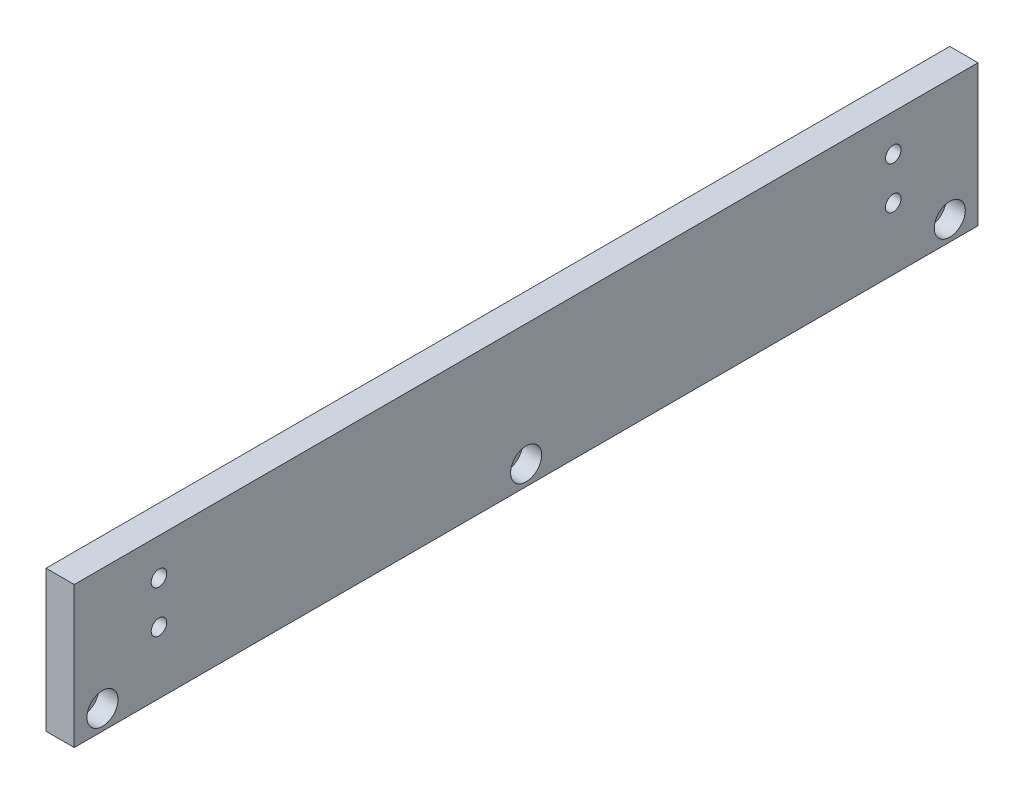
ISO-10303-21;
HEADER;
FILE_DESCRIPTION(('STEP AP214'),'2;1');
FILE_NAME('part.step','',(''),(''),'','','');
FILE_SCHEMA(('AUTOMOTIVE_DESIGN { 1 0 10303 214 1 1 1 1 }'));
ENDSEC;
DATA;
#1=APPLICATION_CONTEXT('core data for automotive mechanical design processes');
#2=APPLICATION_PROTOCOL_DEFINITION('international standard','automotive_design',2000,#1);
#3=PRODUCT_CONTEXT('',#1,'mechanical');
#4=PRODUCT('Part','Part','',(#3));
#5=PRODUCT_RELATED_PRODUCT_CATEGORY('part','',(#4));
#6=PRODUCT_DEFINITION_FORMATION('','',#4);
#7=PRODUCT_DEFINITION_CONTEXT('part definition',#1,'design');
#8=PRODUCT_DEFINITION('design','',#6,#7);
#9=PRODUCT_DEFINITION_SHAPE('','',#8);
#10=(LENGTH_UNIT() NAMED_UNIT(*) SI_UNIT(.MILLI.,.METRE.));
#11=(NAMED_UNIT(*) PLANE_ANGLE_UNIT() SI_UNIT($,.RADIAN.));
#12=(NAMED_UNIT(*) SI_UNIT($,.STERADIAN.) SOLID_ANGLE_UNIT());
#13=UNCERTAINTY_MEASURE_WITH_UNIT(LENGTH_MEASURE(1.E-05),#10,'distance_accuracy_value','');
#14=(GEOMETRIC_REPRESENTATION_CONTEXT(3) GLOBAL_UNCERTAINTY_ASSIGNED_CONTEXT((#13)) GLOBAL_UNIT_ASSIGNED_CONTEXT((#10,
#11,#12)) REPRESENTATION_CONTEXT('',''));
#15=CARTESIAN_POINT('',(0.,0.,0.));
#16=DIRECTION('',(0.,0.,1.));
#17=DIRECTION('',(1.,0.,0.));
#18=AXIS2_PLACEMENT_3D('',#15,#16,#17);
#19=CARTESIAN_POINT('',(0.,50.,320.));
#20=DIRECTION('',(1.,0.,0.));
#21=DIRECTION('',(0.,0.,-1.));
#22=AXIS2_PLACEMENT_3D('',#19,#20,#21);
#23=PLANE('',#22);
#24=CARTESIAN_POINT('',(0.,37.,290.));
#25=DIRECTION('',(-1.,0.,0.));
#26=DIRECTION('',(0.,0.,1.));
#27=AXIS2_PLACEMENT_3D('',#24,#25,#26);
#28=CIRCLE('',#27,5.);
#29=CARTESIAN_POINT('',(0.,37.,295.));
#30=VERTEX_POINT('',#29);
#31=EDGE_CURVE('E192',#30,#30,#28,.T.);
#32=ORIENTED_EDGE('',*,*,#31,.F.);
#33=EDGE_LOOP('',(#32));
#34=FACE_BOUND('',#33,.T.);
#35=CARTESIAN_POINT('',(0.,22.,290.));
#36=DIRECTION('',(-1.,0.,0.));
#37=DIRECTION('',(0.,0.,1.));
#38=AXIS2_PLACEMENT_3D('',#35,#36,#37);
#39=CIRCLE('',#38,5.);
#40=CARTESIAN_POINT('',(0.,22.,295.));
#41=VERTEX_POINT('',#40);
#42=EDGE_CURVE('E180',#41,#41,#39,.T.);
#43=ORIENTED_EDGE('',*,*,#42,.F.);
#44=EDGE_LOOP('',(#43));
#45=FACE_BOUND('',#44,.T.);
#46=CARTESIAN_POINT('',(0.,37.,30.));
#47=DIRECTION('',(-1.,0.,0.));
#48=DIRECTION('',(0.,0.,1.));
#49=AXIS2_PLACEMENT_3D('',#46,#47,#48);
#50=CIRCLE('',#49,5.);
#51=CARTESIAN_POINT('',(0.,37.,35.));
#52=VERTEX_POINT('',#51);
#53=EDGE_CURVE('E168',#52,#52,#50,.T.);
#54=ORIENTED_EDGE('',*,*,#53,.F.);
#55=EDGE_LOOP('',(#54));
#56=FACE_BOUND('',#55,.T.);
#57=CARTESIAN_POINT('',(0.,22.,30.));
#58=DIRECTION('',(-1.,0.,0.));
#59=DIRECTION('',(0.,0.,1.));
#60=AXIS2_PLACEMENT_3D('',#57,#58,#59);
#61=CIRCLE('',#60,5.);
#62=CARTESIAN_POINT('',(0.,22.,35.));
#63=VERTEX_POINT('',#62);
#64=EDGE_CURVE('E156',#63,#63,#61,.T.);
#65=ORIENTED_EDGE('',*,*,#64,.F.);
#66=EDGE_LOOP('',(#65));
#67=FACE_BOUND('',#66,.T.);
#68=CARTESIAN_POINT('',(0.,7.,310.));
#69=DIRECTION('',(1.,0.,0.));
#70=DIRECTION('',(0.,0.,-1.));
#71=AXIS2_PLACEMENT_3D('',#68,#69,#70);
#72=CIRCLE('',#71,3.3);
#73=CARTESIAN_POINT('',(0.,7.,306.7));
#74=VERTEX_POINT('',#73);
#75=EDGE_CURVE('E135',#74,#74,#72,.T.);
#76=ORIENTED_EDGE('',*,*,#75,.T.);
#77=EDGE_LOOP('',(#76));
#78=FACE_BOUND('',#77,.T.);
#79=CARTESIAN_POINT('',(0.,7.,160.));
#80=DIRECTION('',(1.,0.,0.));
#81=DIRECTION('',(0.,0.,-1.));
#82=AXIS2_PLACEMENT_3D('',#79,#80,#81);
#83=CIRCLE('',#82,3.3);
#84=CARTESIAN_POINT('',(0.,7.,156.7));
#85=VERTEX_POINT('',#84);
#86=EDGE_CURVE('E123',#85,#85,#83,.T.);
#87=ORIENTED_EDGE('',*,*,#86,.T.);
#88=EDGE_LOOP('',(#87));
#89=FACE_BOUND('',#88,.T.);
#90=CARTESIAN_POINT('',(0.,7.,10.));
#91=DIRECTION('',(1.,0.,0.));
#92=DIRECTION('',(0.,0.,-1.));
#93=AXIS2_PLACEMENT_3D('',#90,#91,#92);
#94=CIRCLE('',#93,3.3);
#95=CARTESIAN_POINT('',(0.,7.,6.70000000000001));
#96=VERTEX_POINT('',#95);
#97=EDGE_CURVE('E101',#96,#96,#94,.T.);
#98=ORIENTED_EDGE('',*,*,#97,.T.);
#99=EDGE_LOOP('',(#98));
#100=FACE_BOUND('',#99,.T.);
#101=DIRECTION('',(0.,-1.,0.));
#102=VECTOR('',#101,1.);
#103=CARTESIAN_POINT('',(0.,50.,0.));
#104=LINE('',#103,#102);
#105=CARTESIAN_POINT('',(0.,50.,0.));
#106=VERTEX_POINT('',#105);
#107=CARTESIAN_POINT('',(0.,0.,0.));
#108=VERTEX_POINT('',#107);
#109=EDGE_CURVE('E98',#106,#108,#104,.T.);
#110=ORIENTED_EDGE('',*,*,#109,.T.);
#111=DIRECTION('',(0.,0.,-1.));
#112=VECTOR('',#111,1.);
#113=CARTESIAN_POINT('',(0.,0.,320.));
#114=LINE('',#113,#112);
#115=CARTESIAN_POINT('',(0.,0.,320.));
#116=VERTEX_POINT('',#115);
#117=EDGE_CURVE('E11',#116,#108,#114,.T.);
#118=ORIENTED_EDGE('',*,*,#117,.F.);
#119=DIRECTION('',(0.,-1.,0.));
#120=VECTOR('',#119,1.);
#121=CARTESIAN_POINT('',(0.,50.,320.));
#122=LINE('',#121,#120);
#123=CARTESIAN_POINT('',(0.,50.,320.));
#124=VERTEX_POINT('',#123);
#125=EDGE_CURVE('E86',#124,#116,#122,.T.);
#126=ORIENTED_EDGE('',*,*,#125,.F.);
#127=DIRECTION('',(0.,0.,-1.));
#128=VECTOR('',#127,1.);
#129=CARTESIAN_POINT('',(0.,50.,320.));
#130=LINE('',#129,#128);
#131=EDGE_CURVE('E94',#124,#106,#130,.T.);
#132=ORIENTED_EDGE('',*,*,#131,.T.);
#133=EDGE_LOOP('',(#110,#118,#126,#132));
#134=FACE_BOUND('',#133,.T.);
#135=ADVANCED_FACE('F35',(#34,#45,#56,#67,#78,#89,#100,#134),#23,.F.);
#136=CARTESIAN_POINT('',(0.,0.,320.));
#137=DIRECTION('',(0.,1.,0.));
#138=DIRECTION('',(0.,0.,1.));
#139=AXIS2_PLACEMENT_3D('',#136,#137,#138);
#140=PLANE('',#139);
#141=DIRECTION('',(1.,0.,0.));
#142=VECTOR('',#141,1.);
#143=CARTESIAN_POINT('',(0.,0.,0.));
#144=LINE('',#143,#142);
#145=CARTESIAN_POINT('',(10.,0.,0.));
#146=VERTEX_POINT('',#145);
#147=EDGE_CURVE('E90',#108,#146,#144,.T.);
#148=ORIENTED_EDGE('',*,*,#147,.T.);
#149=DIRECTION('',(0.,0.,-1.));
#150=VECTOR('',#149,1.);
#151=CARTESIAN_POINT('',(10.,0.,320.));
#152=LINE('',#151,#150);
#153=CARTESIAN_POINT('',(10.,0.,320.));
#154=VERTEX_POINT('',#153);
#155=EDGE_CURVE('E43',#154,#146,#152,.T.);
#156=ORIENTED_EDGE('',*,*,#155,.F.);
#157=DIRECTION('',(1.,0.,0.));
#158=VECTOR('',#157,1.);
#159=CARTESIAN_POINT('',(0.,0.,320.));
#160=LINE('',#159,#158);
#161=EDGE_CURVE('E81',#116,#154,#160,.T.);
#162=ORIENTED_EDGE('',*,*,#161,.F.);
#163=ORIENTED_EDGE('',*,*,#117,.T.);
#164=EDGE_LOOP('',(#148,#156,#162,#163));
#165=FACE_BOUND('',#164,.T.);
#166=ADVANCED_FACE('F89',(#165),#140,.F.);
#167=CARTESIAN_POINT('',(10.,0.,320.));
#168=DIRECTION('',(-1.,0.,0.));
#169=DIRECTION('',(0.,0.,1.));
#170=AXIS2_PLACEMENT_3D('',#167,#168,#169);
#171=PLANE('',#170);
#172=CARTESIAN_POINT('',(10.,37.,290.));
#173=DIRECTION('',(-1.,0.,0.));
#174=DIRECTION('',(0.,0.,1.));
#175=AXIS2_PLACEMENT_3D('',#172,#173,#174);
#176=CIRCLE('',#175,2.75);
#177=CARTESIAN_POINT('',(10.,37.,292.75));
#178=VERTEX_POINT('',#177);
#179=EDGE_CURVE('E183',#178,#178,#176,.T.);
#180=ORIENTED_EDGE('',*,*,#179,.T.);
#181=EDGE_LOOP('',(#180));
#182=FACE_BOUND('',#181,.T.);
#183=CARTESIAN_POINT('',(10.,22.,290.));
#184=DIRECTION('',(-1.,0.,0.));
#185=DIRECTION('',(0.,0.,1.));
#186=AXIS2_PLACEMENT_3D('',#183,#184,#185);
#187=CIRCLE('',#186,2.75);
#188=CARTESIAN_POINT('',(10.,22.,292.75));
#189=VERTEX_POINT('',#188);
#190=EDGE_CURVE('E171',#189,#189,#187,.T.);
#191=ORIENTED_EDGE('',*,*,#190,.T.);
#192=EDGE_LOOP('',(#191));
#193=FACE_BOUND('',#192,.T.);
#194=CARTESIAN_POINT('',(10.,37.,30.));
#195=DIRECTION('',(-1.,0.,0.));
#196=DIRECTION('',(0.,0.,1.));
#197=AXIS2_PLACEMENT_3D('',#194,#195,#196);
#198=CIRCLE('',#197,2.75);
#199=CARTESIAN_POINT('',(10.,37.,32.75));
#200=VERTEX_POINT('',#199);
#201=EDGE_CURVE('E159',#200,#200,#198,.T.);
#202=ORIENTED_EDGE('',*,*,#201,.T.);
#203=EDGE_LOOP('',(#202));
#204=FACE_BOUND('',#203,.T.);
#205=CARTESIAN_POINT('',(10.,22.,30.));
#206=DIRECTION('',(-1.,0.,0.));
#207=DIRECTION('',(0.,0.,1.));
#208=AXIS2_PLACEMENT_3D('',#205,#206,#207);
#209=CIRCLE('',#208,2.75);
#210=CARTESIAN_POINT('',(10.,22.,32.75));
#211=VERTEX_POINT('',#210);
#212=EDGE_CURVE('E147',#211,#211,#209,.T.);
#213=ORIENTED_EDGE('',*,*,#212,.T.);
#214=EDGE_LOOP('',(#213));
#215=FACE_BOUND('',#214,.T.);
#216=CARTESIAN_POINT('',(10.,7.,310.));
#217=DIRECTION('',(1.,0.,0.));
#218=DIRECTION('',(0.,0.,-1.));
#219=AXIS2_PLACEMENT_3D('',#216,#217,#218);
#220=CIRCLE('',#219,5.5);
#221=CARTESIAN_POINT('',(10.,7.,304.5));
#222=VERTEX_POINT('',#221);
#223=EDGE_CURVE('E144',#222,#222,#220,.T.);
#224=ORIENTED_EDGE('',*,*,#223,.F.);
#225=EDGE_LOOP('',(#224));
#226=FACE_BOUND('',#225,.T.);
#227=CARTESIAN_POINT('',(10.,7.,160.));
#228=DIRECTION('',(1.,0.,0.));
#229=DIRECTION('',(0.,0.,-1.));
#230=AXIS2_PLACEMENT_3D('',#227,#228,#229);
#231=CIRCLE('',#230,5.5);
#232=CARTESIAN_POINT('',(10.,7.,154.5));
#233=VERTEX_POINT('',#232);
#234=EDGE_CURVE('E132',#233,#233,#231,.T.);
#235=ORIENTED_EDGE('',*,*,#234,.F.);
#236=EDGE_LOOP('',(#235));
#237=FACE_BOUND('',#236,.T.);
#238=CARTESIAN_POINT('',(10.,7.,10.));
#239=DIRECTION('',(1.,0.,0.));
#240=DIRECTION('',(0.,0.,-1.));
#241=AXIS2_PLACEMENT_3D('',#238,#239,#240);
#242=CIRCLE('',#241,5.5);
#243=CARTESIAN_POINT('',(10.,7.,4.50000000000001));
#244=VERTEX_POINT('',#243);
#245=EDGE_CURVE('E120',#244,#244,#242,.T.);
#246=ORIENTED_EDGE('',*,*,#245,.F.);
#247=EDGE_LOOP('',(#246));
#248=FACE_BOUND('',#247,.T.);
#249=DIRECTION('',(0.,1.,0.));
#250=VECTOR('',#249,1.);
#251=CARTESIAN_POINT('',(10.,0.,0.));
#252=LINE('',#251,#250);
#253=CARTESIAN_POINT('',(10.,50.,0.));
#254=VERTEX_POINT('',#253);
#255=EDGE_CURVE('E68',#146,#254,#252,.T.);
#256=ORIENTED_EDGE('',*,*,#255,.T.);
#257=DIRECTION('',(0.,0.,-1.));
#258=VECTOR('',#257,1.);
#259=CARTESIAN_POINT('',(10.,50.,320.));
#260=LINE('',#259,#258);
#261=CARTESIAN_POINT('',(10.,50.,320.));
#262=VERTEX_POINT('',#261);
#263=EDGE_CURVE('E91',#262,#254,#260,.T.);
#264=ORIENTED_EDGE('',*,*,#263,.F.);
#265=DIRECTION('',(0.,1.,0.));
#266=VECTOR('',#265,1.);
#267=CARTESIAN_POINT('',(10.,0.,320.));
#268=LINE('',#267,#266);
#269=EDGE_CURVE('E84',#154,#262,#268,.T.);
#270=ORIENTED_EDGE('',*,*,#269,.F.);
#271=ORIENTED_EDGE('',*,*,#155,.T.);
#272=EDGE_LOOP('',(#256,#264,#270,#271));
#273=FACE_BOUND('',#272,.T.);
#274=ADVANCED_FACE('F92',(#182,#193,#204,#215,#226,#237,#248,#273),#171,.F.);
#275=CARTESIAN_POINT('',(10.,50.,320.));
#276=DIRECTION('',(0.,-1.,0.));
#277=DIRECTION('',(0.,0.,-1.));
#278=AXIS2_PLACEMENT_3D('',#275,#276,#277);
#279=PLANE('',#278);
#280=DIRECTION('',(-1.,0.,0.));
#281=VECTOR('',#280,1.);
#282=CARTESIAN_POINT('',(10.,50.,0.));
#283=LINE('',#282,#281);
#284=EDGE_CURVE('E74',#254,#106,#283,.T.);
#285=ORIENTED_EDGE('',*,*,#284,.T.);
#286=ORIENTED_EDGE('',*,*,#131,.F.);
#287=DIRECTION('',(-1.,0.,0.));
#288=VECTOR('',#287,1.);
#289=CARTESIAN_POINT('',(10.,50.,320.));
#290=LINE('',#289,#288);
#291=EDGE_CURVE('E51',#262,#124,#290,.T.);
#292=ORIENTED_EDGE('',*,*,#291,.F.);
#293=ORIENTED_EDGE('',*,*,#263,.T.);
#294=EDGE_LOOP('',(#285,#286,#292,#293));
#295=FACE_BOUND('',#294,.T.);
#296=ADVANCED_FACE('F106',(#295),#279,.F.);
#297=CARTESIAN_POINT('',(0.,0.,320.));
#298=DIRECTION('',(0.,0.,1.));
#299=DIRECTION('',(1.,0.,0.));
#300=AXIS2_PLACEMENT_3D('',#297,#298,#299);
#301=PLANE('',#300);
#302=ORIENTED_EDGE('',*,*,#125,.T.);
#303=ORIENTED_EDGE('',*,*,#161,.T.);
#304=ORIENTED_EDGE('',*,*,#269,.T.);
#305=ORIENTED_EDGE('',*,*,#291,.T.);
#306=EDGE_LOOP('',(#302,#303,#304,#305));
#307=FACE_BOUND('',#306,.T.);
#308=ADVANCED_FACE('F82',(#307),#301,.T.);
#309=CARTESIAN_POINT('',(0.,0.,0.));
#310=DIRECTION('',(0.,0.,1.));
#311=DIRECTION('',(1.,0.,0.));
#312=AXIS2_PLACEMENT_3D('',#309,#310,#311);
#313=PLANE('',#312);
#314=ORIENTED_EDGE('',*,*,#109,.F.);
#315=ORIENTED_EDGE('',*,*,#284,.F.);
#316=ORIENTED_EDGE('',*,*,#255,.F.);
#317=ORIENTED_EDGE('',*,*,#147,.F.);
#318=EDGE_LOOP('',(#314,#315,#316,#317));
#319=FACE_BOUND('',#318,.T.);
#320=ADVANCED_FACE('F109',(#319),#313,.F.);
#321=CARTESIAN_POINT('',(10.,7.,10.));
#322=DIRECTION('',(1.,0.,0.));
#323=DIRECTION('',(0.,0.,-1.));
#324=AXIS2_PLACEMENT_3D('',#321,#322,#323);
#325=CYLINDRICAL_SURFACE('',#324,3.3);
#326=ORIENTED_EDGE('',*,*,#97,.F.);
#327=EDGE_LOOP('',(#326));
#328=FACE_BOUND('',#327,.T.);
#329=CARTESIAN_POINT('',(3.2,7.,10.));
#330=DIRECTION('',(1.,0.,0.));
#331=DIRECTION('',(0.,0.,-1.));
#332=AXIS2_PLACEMENT_3D('',#329,#330,#331);
#333=CIRCLE('',#332,3.3);
#334=CARTESIAN_POINT('',(3.2,7.,6.70000000000001));
#335=VERTEX_POINT('',#334);
#336=EDGE_CURVE('E114',#335,#335,#333,.T.);
#337=ORIENTED_EDGE('',*,*,#336,.T.);
#338=EDGE_LOOP('',(#337));
#339=FACE_BOUND('',#338,.T.);
#340=ADVANCED_FACE('F212',(#328,#339),#325,.F.);
#341=CARTESIAN_POINT('',(3.2,10.3,10.));
#342=DIRECTION('',(-1.,0.,0.));
#343=DIRECTION('',(0.,0.,1.));
#344=AXIS2_PLACEMENT_3D('',#341,#342,#343);
#345=PLANE('',#344);
#346=ORIENTED_EDGE('',*,*,#336,.F.);
#347=EDGE_LOOP('',(#346));
#348=FACE_BOUND('',#347,.T.);
#349=CARTESIAN_POINT('',(3.2,7.,10.));
#350=DIRECTION('',(1.,0.,0.));
#351=DIRECTION('',(0.,0.,-1.));
#352=AXIS2_PLACEMENT_3D('',#349,#350,#351);
#353=CIRCLE('',#352,5.5);
#354=CARTESIAN_POINT('',(3.2,7.,4.50000000000001));
#355=VERTEX_POINT('',#354);
#356=EDGE_CURVE('E117',#355,#355,#353,.T.);
#357=ORIENTED_EDGE('',*,*,#356,.T.);
#358=EDGE_LOOP('',(#357));
#359=FACE_BOUND('',#358,.T.);
#360=ADVANCED_FACE('F215',(#348,#359),#345,.F.);
#361=CARTESIAN_POINT('',(10.,7.,10.));
#362=DIRECTION('',(1.,0.,0.));
#363=DIRECTION('',(0.,0.,-1.));
#364=AXIS2_PLACEMENT_3D('',#361,#362,#363);
#365=CYLINDRICAL_SURFACE('',#364,5.5);
#366=ORIENTED_EDGE('',*,*,#356,.F.);
#367=EDGE_LOOP('',(#366));
#368=FACE_BOUND('',#367,.T.);
#369=ORIENTED_EDGE('',*,*,#245,.T.);
#370=EDGE_LOOP('',(#369));
#371=FACE_BOUND('',#370,.T.);
#372=ADVANCED_FACE('F221',(#368,#371),#365,.F.);
#373=CARTESIAN_POINT('',(10.,7.,160.));
#374=DIRECTION('',(1.,0.,0.));
#375=DIRECTION('',(0.,0.,-1.));
#376=AXIS2_PLACEMENT_3D('',#373,#374,#375);
#377=CYLINDRICAL_SURFACE('',#376,3.3);
#378=ORIENTED_EDGE('',*,*,#86,.F.);
#379=EDGE_LOOP('',(#378));
#380=FACE_BOUND('',#379,.T.);
#381=CARTESIAN_POINT('',(3.2,7.,160.));
#382=DIRECTION('',(1.,0.,0.));
#383=DIRECTION('',(0.,0.,-1.));
#384=AXIS2_PLACEMENT_3D('',#381,#382,#383);
#385=CIRCLE('',#384,3.3);
#386=CARTESIAN_POINT('',(3.2,7.,156.7));
#387=VERTEX_POINT('',#386);
#388=EDGE_CURVE('E126',#387,#387,#385,.T.);
#389=ORIENTED_EDGE('',*,*,#388,.T.);
#390=EDGE_LOOP('',(#389));
#391=FACE_BOUND('',#390,.T.);
#392=ADVANCED_FACE('F227',(#380,#391),#377,.F.);
#393=CARTESIAN_POINT('',(3.2,10.3,160.));
#394=DIRECTION('',(-1.,0.,0.));
#395=DIRECTION('',(0.,0.,1.));
#396=AXIS2_PLACEMENT_3D('',#393,#394,#395);
#397=PLANE('',#396);
#398=ORIENTED_EDGE('',*,*,#388,.F.);
#399=EDGE_LOOP('',(#398));
#400=FACE_BOUND('',#399,.T.);
#401=CARTESIAN_POINT('',(3.2,7.,160.));
#402=DIRECTION('',(1.,0.,0.));
#403=DIRECTION('',(0.,0.,-1.));
#404=AXIS2_PLACEMENT_3D('',#401,#402,#403);
#405=CIRCLE('',#404,5.5);
#406=CARTESIAN_POINT('',(3.2,7.,154.5));
#407=VERTEX_POINT('',#406);
#408=EDGE_CURVE('E129',#407,#407,#405,.T.);
#409=ORIENTED_EDGE('',*,*,#408,.T.);
#410=EDGE_LOOP('',(#409));
#411=FACE_BOUND('',#410,.T.);
#412=ADVANCED_FACE('F247',(#400,#411),#397,.F.);
#413=CARTESIAN_POINT('',(10.,7.,160.));
#414=DIRECTION('',(1.,0.,0.));
#415=DIRECTION('',(0.,0.,-1.));
#416=AXIS2_PLACEMENT_3D('',#413,#414,#415);
#417=CYLINDRICAL_SURFACE('',#416,5.5);
#418=ORIENTED_EDGE('',*,*,#408,.F.);
#419=EDGE_LOOP('',(#418));
#420=FACE_BOUND('',#419,.T.);
#421=ORIENTED_EDGE('',*,*,#234,.T.);
#422=EDGE_LOOP('',(#421));
#423=FACE_BOUND('',#422,.T.);
#424=ADVANCED_FACE('F251',(#420,#423),#417,.F.);
#425=CARTESIAN_POINT('',(10.,7.,310.));
#426=DIRECTION('',(1.,0.,0.));
#427=DIRECTION('',(0.,0.,-1.));
#428=AXIS2_PLACEMENT_3D('',#425,#426,#427);
#429=CYLINDRICAL_SURFACE('',#428,3.3);
#430=ORIENTED_EDGE('',*,*,#75,.F.);
#431=EDGE_LOOP('',(#430));
#432=FACE_BOUND('',#431,.T.);
#433=CARTESIAN_POINT('',(3.2,7.,310.));
#434=DIRECTION('',(1.,0.,0.));
#435=DIRECTION('',(0.,0.,-1.));
#436=AXIS2_PLACEMENT_3D('',#433,#434,#435);
#437=CIRCLE('',#436,3.3);
#438=CARTESIAN_POINT('',(3.2,7.,306.7));
#439=VERTEX_POINT('',#438);
#440=EDGE_CURVE('E138',#439,#439,#437,.T.);
#441=ORIENTED_EDGE('',*,*,#440,.T.);
#442=EDGE_LOOP('',(#441));
#443=FACE_BOUND('',#442,.T.);
#444=ADVANCED_FACE('F255',(#432,#443),#429,.F.);
#445=CARTESIAN_POINT('',(3.2,10.3,310.));
#446=DIRECTION('',(-1.,0.,0.));
#447=DIRECTION('',(0.,0.,1.));
#448=AXIS2_PLACEMENT_3D('',#445,#446,#447);
#449=PLANE('',#448);
#450=ORIENTED_EDGE('',*,*,#440,.F.);
#451=EDGE_LOOP('',(#450));
#452=FACE_BOUND('',#451,.T.);
#453=CARTESIAN_POINT('',(3.2,7.,310.));
#454=DIRECTION('',(1.,0.,0.));
#455=DIRECTION('',(0.,0.,-1.));
#456=AXIS2_PLACEMENT_3D('',#453,#454,#455);
#457=CIRCLE('',#456,5.5);
#458=CARTESIAN_POINT('',(3.2,7.,304.5));
#459=VERTEX_POINT('',#458);
#460=EDGE_CURVE('E141',#459,#459,#457,.T.);
#461=ORIENTED_EDGE('',*,*,#460,.T.);
#462=EDGE_LOOP('',(#461));
#463=FACE_BOUND('',#462,.T.);
#464=ADVANCED_FACE('F259',(#452,#463),#449,.F.);
#465=CARTESIAN_POINT('',(10.,7.,310.));
#466=DIRECTION('',(1.,0.,0.));
#467=DIRECTION('',(0.,0.,-1.));
#468=AXIS2_PLACEMENT_3D('',#465,#466,#467);
#469=CYLINDRICAL_SURFACE('',#468,5.5);
#470=ORIENTED_EDGE('',*,*,#460,.F.);
#471=EDGE_LOOP('',(#470));
#472=FACE_BOUND('',#471,.T.);
#473=ORIENTED_EDGE('',*,*,#223,.T.);
#474=EDGE_LOOP('',(#473));
#475=FACE_BOUND('',#474,.T.);
#476=ADVANCED_FACE('F263',(#472,#475),#469,.F.);
#477=CARTESIAN_POINT('',(0.,22.,30.));
#478=DIRECTION('',(-1.,0.,0.));
#479=DIRECTION('',(0.,0.,1.));
#480=AXIS2_PLACEMENT_3D('',#477,#478,#479);
#481=CYLINDRICAL_SURFACE('',#480,2.75);
#482=ORIENTED_EDGE('',*,*,#212,.F.);
#483=EDGE_LOOP('',(#482));
#484=FACE_BOUND('',#483,.T.);
#485=CARTESIAN_POINT('',(5.7,22.,30.));
#486=DIRECTION('',(-1.,0.,0.));
#487=DIRECTION('',(0.,0.,1.));
#488=AXIS2_PLACEMENT_3D('',#485,#486,#487);
#489=CIRCLE('',#488,2.75);
#490=CARTESIAN_POINT('',(5.7,22.,32.75));
#491=VERTEX_POINT('',#490);
#492=EDGE_CURVE('E150',#491,#491,#489,.T.);
#493=ORIENTED_EDGE('',*,*,#492,.T.);
#494=EDGE_LOOP('',(#493));
#495=FACE_BOUND('',#494,.T.);
#496=ADVANCED_FACE('F267',(#484,#495),#481,.F.);
#497=CARTESIAN_POINT('',(5.7,24.75,30.));
#498=DIRECTION('',(1.,0.,0.));
#499=DIRECTION('',(0.,0.,-1.));
#500=AXIS2_PLACEMENT_3D('',#497,#498,#499);
#501=PLANE('',#500);
#502=ORIENTED_EDGE('',*,*,#492,.F.);
#503=EDGE_LOOP('',(#502));
#504=FACE_BOUND('',#503,.T.);
#505=CARTESIAN_POINT('',(5.7,22.,30.));
#506=DIRECTION('',(-1.,0.,0.));
#507=DIRECTION('',(0.,0.,1.));
#508=AXIS2_PLACEMENT_3D('',#505,#506,#507);
#509=CIRCLE('',#508,5.);
#510=CARTESIAN_POINT('',(5.7,22.,35.));
#511=VERTEX_POINT('',#510);
#512=EDGE_CURVE('E153',#511,#511,#509,.T.);
#513=ORIENTED_EDGE('',*,*,#512,.T.);
#514=EDGE_LOOP('',(#513));
#515=FACE_BOUND('',#514,.T.);
#516=ADVANCED_FACE('F271',(#504,#515),#501,.F.);
#517=CARTESIAN_POINT('',(0.,22.,30.));
#518=DIRECTION('',(-1.,0.,0.));
#519=DIRECTION('',(0.,0.,1.));
#520=AXIS2_PLACEMENT_3D('',#517,#518,#519);
#521=CYLINDRICAL_SURFACE('',#520,5.);
#522=ORIENTED_EDGE('',*,*,#512,.F.);
#523=EDGE_LOOP('',(#522));
#524=FACE_BOUND('',#523,.T.);
#525=ORIENTED_EDGE('',*,*,#64,.T.);
#526=EDGE_LOOP('',(#525));
#527=FACE_BOUND('',#526,.T.);
#528=ADVANCED_FACE('F275',(#524,#527),#521,.F.);
#529=CARTESIAN_POINT('',(0.,37.,30.));
#530=DIRECTION('',(-1.,0.,0.));
#531=DIRECTION('',(0.,0.,1.));
#532=AXIS2_PLACEMENT_3D('',#529,#530,#531);
#533=CYLINDRICAL_SURFACE('',#532,2.75);
#534=ORIENTED_EDGE('',*,*,#201,.F.);
#535=EDGE_LOOP('',(#534));
#536=FACE_BOUND('',#535,.T.);
#537=CARTESIAN_POINT('',(5.69999999999999,37.,30.));
#538=DIRECTION('',(-1.,0.,0.));
#539=DIRECTION('',(0.,0.,1.));
#540=AXIS2_PLACEMENT_3D('',#537,#538,#539);
#541=CIRCLE('',#540,2.75);
#542=CARTESIAN_POINT('',(5.69999999999999,37.,32.75));
#543=VERTEX_POINT('',#542);
#544=EDGE_CURVE('E162',#543,#543,#541,.T.);
#545=ORIENTED_EDGE('',*,*,#544,.T.);
#546=EDGE_LOOP('',(#545));
#547=FACE_BOUND('',#546,.T.);
#548=ADVANCED_FACE('F279',(#536,#547),#533,.F.);
#549=CARTESIAN_POINT('',(5.69999999999999,39.75,30.));
#550=DIRECTION('',(1.,0.,0.));
#551=DIRECTION('',(0.,0.,-1.));
#552=AXIS2_PLACEMENT_3D('',#549,#550,#551);
#553=PLANE('',#552);
#554=ORIENTED_EDGE('',*,*,#544,.F.);
#555=EDGE_LOOP('',(#554));
#556=FACE_BOUND('',#555,.T.);
#557=CARTESIAN_POINT('',(5.69999999999999,37.,30.));
#558=DIRECTION('',(-1.,0.,0.));
#559=DIRECTION('',(0.,0.,1.));
#560=AXIS2_PLACEMENT_3D('',#557,#558,#559);
#561=CIRCLE('',#560,5.);
#562=CARTESIAN_POINT('',(5.69999999999999,37.,35.));
#563=VERTEX_POINT('',#562);
#564=EDGE_CURVE('E165',#563,#563,#561,.T.);
#565=ORIENTED_EDGE('',*,*,#564,.T.);
#566=EDGE_LOOP('',(#565));
#567=FACE_BOUND('',#566,.T.);
#568=ADVANCED_FACE('F283',(#556,#567),#553,.F.);
#569=CARTESIAN_POINT('',(0.,37.,30.));
#570=DIRECTION('',(-1.,0.,0.));
#571=DIRECTION('',(0.,0.,1.));
#572=AXIS2_PLACEMENT_3D('',#569,#570,#571);
#573=CYLINDRICAL_SURFACE('',#572,5.);
#574=ORIENTED_EDGE('',*,*,#564,.F.);
#575=EDGE_LOOP('',(#574));
#576=FACE_BOUND('',#575,.T.);
#577=ORIENTED_EDGE('',*,*,#53,.T.);
#578=EDGE_LOOP('',(#577));
#579=FACE_BOUND('',#578,.T.);
#580=ADVANCED_FACE('F287',(#576,#579),#573,.F.);
#581=CARTESIAN_POINT('',(0.,22.,290.));
#582=DIRECTION('',(-1.,0.,0.));
#583=DIRECTION('',(0.,0.,1.));
#584=AXIS2_PLACEMENT_3D('',#581,#582,#583);
#585=CYLINDRICAL_SURFACE('',#584,2.75);
#586=ORIENTED_EDGE('',*,*,#190,.F.);
#587=EDGE_LOOP('',(#586));
#588=FACE_BOUND('',#587,.T.);
#589=CARTESIAN_POINT('',(5.7,22.,290.));
#590=DIRECTION('',(-1.,0.,0.));
#591=DIRECTION('',(0.,0.,1.));
#592=AXIS2_PLACEMENT_3D('',#589,#590,#591);
#593=CIRCLE('',#592,2.75);
#594=CARTESIAN_POINT('',(5.7,22.,292.75));
#595=VERTEX_POINT('',#594);
#596=EDGE_CURVE('E174',#595,#595,#593,.T.);
#597=ORIENTED_EDGE('',*,*,#596,.T.);
#598=EDGE_LOOP('',(#597));
#599=FACE_BOUND('',#598,.T.);
#600=ADVANCED_FACE('F291',(#588,#599),#585,.F.);
#601=CARTESIAN_POINT('',(5.7,24.75,290.));
#602=DIRECTION('',(1.,0.,0.));
#603=DIRECTION('',(0.,0.,-1.));
#604=AXIS2_PLACEMENT_3D('',#601,#602,#603);
#605=PLANE('',#604);
#606=ORIENTED_EDGE('',*,*,#596,.F.);
#607=EDGE_LOOP('',(#606));
#608=FACE_BOUND('',#607,.T.);
#609=CARTESIAN_POINT('',(5.7,22.,290.));
#610=DIRECTION('',(-1.,0.,0.));
#611=DIRECTION('',(0.,0.,1.));
#612=AXIS2_PLACEMENT_3D('',#609,#610,#611);
#613=CIRCLE('',#612,5.);
#614=CARTESIAN_POINT('',(5.7,22.,295.));
#615=VERTEX_POINT('',#614);
#616=EDGE_CURVE('E177',#615,#615,#613,.T.);
#617=ORIENTED_EDGE('',*,*,#616,.T.);
#618=EDGE_LOOP('',(#617));
#619=FACE_BOUND('',#618,.T.);
#620=ADVANCED_FACE('F295',(#608,#619),#605,.F.);
#621=CARTESIAN_POINT('',(0.,22.,290.));
#622=DIRECTION('',(-1.,0.,0.));
#623=DIRECTION('',(0.,0.,1.));
#624=AXIS2_PLACEMENT_3D('',#621,#622,#623);
#625=CYLINDRICAL_SURFACE('',#624,5.);
#626=ORIENTED_EDGE('',*,*,#616,.F.);
#627=EDGE_LOOP('',(#626));
#628=FACE_BOUND('',#627,.T.);
#629=ORIENTED_EDGE('',*,*,#42,.T.);
#630=EDGE_LOOP('',(#629));
#631=FACE_BOUND('',#630,.T.);
#632=ADVANCED_FACE('F299',(#628,#631),#625,.F.);
#633=CARTESIAN_POINT('',(0.,37.,290.));
#634=DIRECTION('',(-1.,0.,0.));
#635=DIRECTION('',(0.,0.,1.));
#636=AXIS2_PLACEMENT_3D('',#633,#634,#635);
#637=CYLINDRICAL_SURFACE('',#636,2.75);
#638=ORIENTED_EDGE('',*,*,#179,.F.);
#639=EDGE_LOOP('',(#638));
#640=FACE_BOUND('',#639,.T.);
#641=CARTESIAN_POINT('',(5.69999999999999,37.,290.));
#642=DIRECTION('',(-1.,0.,0.));
#643=DIRECTION('',(0.,0.,1.));
#644=AXIS2_PLACEMENT_3D('',#641,#642,#643);
#645=CIRCLE('',#644,2.75);
#646=CARTESIAN_POINT('',(5.69999999999999,37.,292.75));
#647=VERTEX_POINT('',#646);
#648=EDGE_CURVE('E186',#647,#647,#645,.T.);
#649=ORIENTED_EDGE('',*,*,#648,.T.);
#650=EDGE_LOOP('',(#649));
#651=FACE_BOUND('',#650,.T.);
#652=ADVANCED_FACE('F303',(#640,#651),#637,.F.);
#653=CARTESIAN_POINT('',(5.69999999999999,39.75,290.));
#654=DIRECTION('',(1.,0.,0.));
#655=DIRECTION('',(0.,0.,-1.));
#656=AXIS2_PLACEMENT_3D('',#653,#654,#655);
#657=PLANE('',#656);
#658=ORIENTED_EDGE('',*,*,#648,.F.);
#659=EDGE_LOOP('',(#658));
#660=FACE_BOUND('',#659,.T.);
#661=CARTESIAN_POINT('',(5.69999999999999,37.,290.));
#662=DIRECTION('',(-1.,0.,0.));
#663=DIRECTION('',(0.,0.,1.));
#664=AXIS2_PLACEMENT_3D('',#661,#662,#663);
#665=CIRCLE('',#664,5.);
#666=CARTESIAN_POINT('',(5.69999999999999,37.,295.));
#667=VERTEX_POINT('',#666);
#668=EDGE_CURVE('E189',#667,#667,#665,.T.);
#669=ORIENTED_EDGE('',*,*,#668,.T.);
#670=EDGE_LOOP('',(#669));
#671=FACE_BOUND('',#670,.T.);
#672=ADVANCED_FACE('F307',(#660,#671),#657,.F.);
#673=CARTESIAN_POINT('',(0.,37.,290.));
#674=DIRECTION('',(-1.,0.,0.));
#675=DIRECTION('',(0.,0.,1.));
#676=AXIS2_PLACEMENT_3D('',#673,#674,#675);
#677=CYLINDRICAL_SURFACE('',#676,5.);
#678=ORIENTED_EDGE('',*,*,#668,.F.);
#679=EDGE_LOOP('',(#678));
#680=FACE_BOUND('',#679,.T.);
#681=ORIENTED_EDGE('',*,*,#31,.T.);
#682=EDGE_LOOP('',(#681));
#683=FACE_BOUND('',#682,.T.);
#684=ADVANCED_FACE('F196',(#680,#683),#677,.F.);
#685=CLOSED_SHELL('',(#135,#166,#274,#296,#308,#320,#340,#360,#372,#392,#412,#424,#444,#464,
#476,#496,#516,#528,#548,#568,#580,#600,#620,#632,#652,#672,#684));
#686=MANIFOLD_SOLID_BREP('B2',#685);
#687=ADVANCED_BREP_SHAPE_REPRESENTATION('',(#18,#686),#14);
#688=SHAPE_DEFINITION_REPRESENTATION(#9,#687);
ENDSEC;
END-ISO-10303-21;
